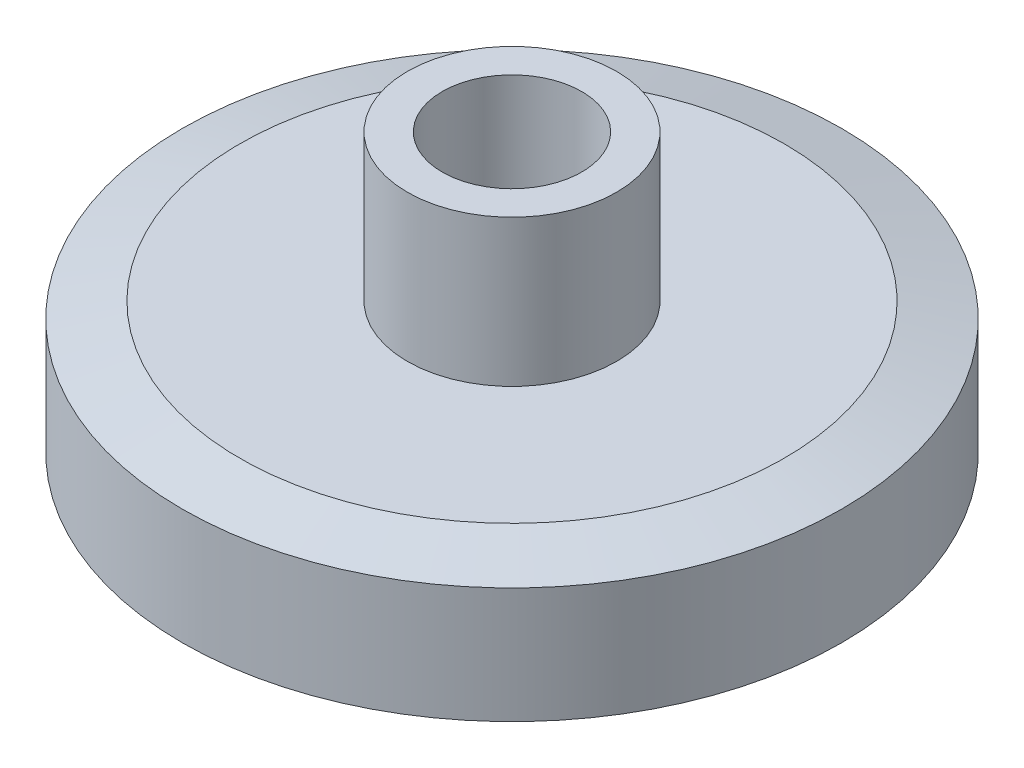
ISO-10303-21;
HEADER;
FILE_DESCRIPTION(('STEP AP214'),'2;1');
FILE_NAME('part.step','',(''),(''),'','','');
FILE_SCHEMA(('AUTOMOTIVE_DESIGN { 1 0 10303 214 1 1 1 1 }'));
ENDSEC;
DATA;
#1=APPLICATION_CONTEXT('core data for automotive mechanical design processes');
#2=APPLICATION_PROTOCOL_DEFINITION('international standard','automotive_design',2000,#1);
#3=PRODUCT_CONTEXT('',#1,'mechanical');
#4=PRODUCT('Part','Part','',(#3));
#5=PRODUCT_RELATED_PRODUCT_CATEGORY('part','',(#4));
#6=PRODUCT_DEFINITION_FORMATION('','',#4);
#7=PRODUCT_DEFINITION_CONTEXT('part definition',#1,'design');
#8=PRODUCT_DEFINITION('design','',#6,#7);
#9=PRODUCT_DEFINITION_SHAPE('','',#8);
#10=(LENGTH_UNIT() NAMED_UNIT(*) SI_UNIT(.MILLI.,.METRE.));
#11=(NAMED_UNIT(*) PLANE_ANGLE_UNIT() SI_UNIT($,.RADIAN.));
#12=(NAMED_UNIT(*) SI_UNIT($,.STERADIAN.) SOLID_ANGLE_UNIT());
#13=UNCERTAINTY_MEASURE_WITH_UNIT(LENGTH_MEASURE(1.E-05),#10,'distance_accuracy_value','');
#14=(GEOMETRIC_REPRESENTATION_CONTEXT(3) GLOBAL_UNCERTAINTY_ASSIGNED_CONTEXT((#13)) GLOBAL_UNIT_ASSIGNED_CONTEXT((#10,
#11,#12)) REPRESENTATION_CONTEXT('',''));
#15=CARTESIAN_POINT('',(0.,0.,0.));
#16=DIRECTION('',(0.,0.,1.));
#17=DIRECTION('',(1.,0.,0.));
#18=AXIS2_PLACEMENT_3D('',#15,#16,#17);
#19=CARTESIAN_POINT('',(0.,0.,0.));
#20=DIRECTION('',(0.,1.,0.));
#21=DIRECTION('',(0.,0.,1.));
#22=AXIS2_PLACEMENT_3D('',#19,#20,#21);
#23=PLANE('',#22);
#24=CARTESIAN_POINT('',(0.,0.,0.));
#25=DIRECTION('',(0.,1.,0.));
#26=DIRECTION('',(-1.,0.,0.));
#27=AXIS2_PLACEMENT_3D('',#24,#25,#26);
#28=CIRCLE('',#27,2.);
#29=CARTESIAN_POINT('',(-2.,0.,0.));
#30=VERTEX_POINT('',#29);
#31=EDGE_CURVE('E72',#30,#30,#28,.T.);
#32=ORIENTED_EDGE('',*,*,#31,.T.);
#33=EDGE_LOOP('',(#32));
#34=FACE_BOUND('',#33,.T.);
#35=CARTESIAN_POINT('',(0.,0.,0.));
#36=DIRECTION('',(0.,1.,0.));
#37=DIRECTION('',(0.,0.,1.));
#38=AXIS2_PLACEMENT_3D('',#35,#36,#37);
#39=CIRCLE('',#38,7.80499999999997);
#40=CARTESIAN_POINT('',(0.,0.,7.80499999999997));
#41=VERTEX_POINT('',#40);
#42=EDGE_CURVE('E10',#41,#41,#39,.F.);
#43=ORIENTED_EDGE('',*,*,#42,.T.);
#44=EDGE_LOOP('',(#43));
#45=FACE_BOUND('',#44,.T.);
#46=ADVANCED_FACE('F39',(#34,#45),#23,.F.);
#47=CARTESIAN_POINT('',(0.,8.4,0.));
#48=DIRECTION('',(0.,1.,0.));
#49=DIRECTION('',(0.,0.,1.));
#50=AXIS2_PLACEMENT_3D('',#47,#48,#49);
#51=CYLINDRICAL_SURFACE('',#50,9.45);
#52=CARTESIAN_POINT('',(0.,0.440776421549199,0.));
#53=DIRECTION('',(0.,1.,0.));
#54=DIRECTION('',(0.,0.,1.));
#55=AXIS2_PLACEMENT_3D('',#52,#53,#54);
#56=CIRCLE('',#55,9.45);
#57=CARTESIAN_POINT('',(0.,0.440776421549199,9.45));
#58=VERTEX_POINT('',#57);
#59=EDGE_CURVE('E48',#58,#58,#56,.T.);
#60=ORIENTED_EDGE('',*,*,#59,.T.);
#61=EDGE_LOOP('',(#60));
#62=FACE_BOUND('',#61,.T.);
#63=CARTESIAN_POINT('',(0.,3.7592235784508,0.));
#64=DIRECTION('',(0.,-1.,0.));
#65=DIRECTION('',(0.,0.,-1.));
#66=AXIS2_PLACEMENT_3D('',#63,#64,#65);
#67=CIRCLE('',#66,9.45);
#68=CARTESIAN_POINT('',(0.,3.7592235784508,-9.45));
#69=VERTEX_POINT('',#68);
#70=EDGE_CURVE('E53',#69,#69,#67,.T.);
#71=ORIENTED_EDGE('',*,*,#70,.T.);
#72=EDGE_LOOP('',(#71));
#73=FACE_BOUND('',#72,.T.);
#74=ADVANCED_FACE('F103',(#62,#73),#51,.T.);
#75=CARTESIAN_POINT('',(9.45,4.2,0.));
#76=DIRECTION('',(0.,-1.,0.));
#77=DIRECTION('',(0.,0.,-1.));
#78=AXIS2_PLACEMENT_3D('',#75,#76,#77);
#79=PLANE('',#78);
#80=CARTESIAN_POINT('',(0.,4.2,0.));
#81=DIRECTION('',(0.,-1.,0.));
#82=DIRECTION('',(0.,0.,-1.));
#83=AXIS2_PLACEMENT_3D('',#80,#81,#82);
#84=CIRCLE('',#83,7.80499999999998);
#85=CARTESIAN_POINT('',(0.,4.2,-7.80499999999998));
#86=VERTEX_POINT('',#85);
#87=EDGE_CURVE('E58',#86,#86,#84,.F.);
#88=ORIENTED_EDGE('',*,*,#87,.T.);
#89=EDGE_LOOP('',(#88));
#90=FACE_BOUND('',#89,.T.);
#91=CARTESIAN_POINT('',(0.,4.2,0.));
#92=DIRECTION('',(0.,1.,0.));
#93=DIRECTION('',(0.,0.,1.));
#94=AXIS2_PLACEMENT_3D('',#91,#92,#93);
#95=CIRCLE('',#94,3.);
#96=CARTESIAN_POINT('',(0.,4.2,3.));
#97=VERTEX_POINT('',#96);
#98=EDGE_CURVE('E64',#97,#97,#95,.T.);
#99=ORIENTED_EDGE('',*,*,#98,.F.);
#100=EDGE_LOOP('',(#99));
#101=FACE_BOUND('',#100,.T.);
#102=ADVANCED_FACE('F98',(#90,#101),#79,.F.);
#103=CARTESIAN_POINT('',(0.,8.4,0.));
#104=DIRECTION('',(0.,1.,0.));
#105=DIRECTION('',(0.,0.,1.));
#106=AXIS2_PLACEMENT_3D('',#103,#104,#105);
#107=CYLINDRICAL_SURFACE('',#106,3.);
#108=CARTESIAN_POINT('',(0.,8.4,0.));
#109=DIRECTION('',(0.,1.,0.));
#110=DIRECTION('',(0.,0.,1.));
#111=AXIS2_PLACEMENT_3D('',#108,#109,#110);
#112=CIRCLE('',#111,3.);
#113=CARTESIAN_POINT('',(0.,8.4,3.));
#114=VERTEX_POINT('',#113);
#115=EDGE_CURVE('E68',#114,#114,#112,.T.);
#116=ORIENTED_EDGE('',*,*,#115,.F.);
#117=EDGE_LOOP('',(#116));
#118=FACE_BOUND('',#117,.T.);
#119=ORIENTED_EDGE('',*,*,#98,.T.);
#120=EDGE_LOOP('',(#119));
#121=FACE_BOUND('',#120,.T.);
#122=ADVANCED_FACE('F92',(#118,#121),#107,.T.);
#123=CARTESIAN_POINT('',(3.,8.4,0.));
#124=DIRECTION('',(0.,-1.,0.));
#125=DIRECTION('',(0.,0.,-1.));
#126=AXIS2_PLACEMENT_3D('',#123,#124,#125);
#127=PLANE('',#126);
#128=CARTESIAN_POINT('',(0.,8.4,0.));
#129=DIRECTION('',(0.,1.,0.));
#130=DIRECTION('',(-1.,0.,0.));
#131=AXIS2_PLACEMENT_3D('',#128,#129,#130);
#132=CIRCLE('',#131,2.);
#133=CARTESIAN_POINT('',(-2.,8.4,0.));
#134=VERTEX_POINT('',#133);
#135=EDGE_CURVE('E73',#134,#134,#132,.T.);
#136=ORIENTED_EDGE('',*,*,#135,.F.);
#137=EDGE_LOOP('',(#136));
#138=FACE_BOUND('',#137,.T.);
#139=ORIENTED_EDGE('',*,*,#115,.T.);
#140=EDGE_LOOP('',(#139));
#141=FACE_BOUND('',#140,.T.);
#142=ADVANCED_FACE('F88',(#138,#141),#127,.F.);
#143=CARTESIAN_POINT('',(0.,4.2,0.));
#144=DIRECTION('',(0.,-1.,0.));
#145=DIRECTION('',(0.,0.,-1.));
#146=AXIS2_PLACEMENT_3D('',#143,#144,#145);
#147=CONICAL_SURFACE('',#146,7.80499999999998,1.30899693899575);
#148=ORIENTED_EDGE('',*,*,#70,.F.);
#149=EDGE_LOOP('',(#148));
#150=FACE_BOUND('',#149,.T.);
#151=ORIENTED_EDGE('',*,*,#87,.F.);
#152=EDGE_LOOP('',(#151));
#153=FACE_BOUND('',#152,.T.);
#154=ADVANCED_FACE('F91',(#150,#153),#147,.T.);
#155=CARTESIAN_POINT('',(0.,0.440776421549199,0.));
#156=DIRECTION('',(0.,1.,0.));
#157=DIRECTION('',(0.,0.,1.));
#158=AXIS2_PLACEMENT_3D('',#155,#156,#157);
#159=CONICAL_SURFACE('',#158,9.45,1.30899693899575);
#160=ORIENTED_EDGE('',*,*,#42,.F.);
#161=EDGE_LOOP('',(#160));
#162=FACE_BOUND('',#161,.T.);
#163=ORIENTED_EDGE('',*,*,#59,.F.);
#164=EDGE_LOOP('',(#163));
#165=FACE_BOUND('',#164,.T.);
#166=ADVANCED_FACE('F42',(#162,#165),#159,.T.);
#167=CARTESIAN_POINT('',(0.,0.,0.));
#168=DIRECTION('',(0.,1.,0.));
#169=DIRECTION('',(-1.,0.,0.));
#170=AXIS2_PLACEMENT_3D('',#167,#168,#169);
#171=CYLINDRICAL_SURFACE('',#170,2.);
#172=ORIENTED_EDGE('',*,*,#31,.F.);
#173=EDGE_LOOP('',(#172));
#174=FACE_BOUND('',#173,.T.);
#175=ORIENTED_EDGE('',*,*,#135,.T.);
#176=EDGE_LOOP('',(#175));
#177=FACE_BOUND('',#176,.T.);
#178=ADVANCED_FACE('F82',(#174,#177),#171,.F.);
#179=CLOSED_SHELL('',(#46,#74,#102,#122,#142,#154,#166,#178));
#180=MANIFOLD_SOLID_BREP('B2',#179);
#181=ADVANCED_BREP_SHAPE_REPRESENTATION('',(#18,#180),#14);
#182=SHAPE_DEFINITION_REPRESENTATION(#9,#181);
ENDSEC;
END-ISO-10303-21;
